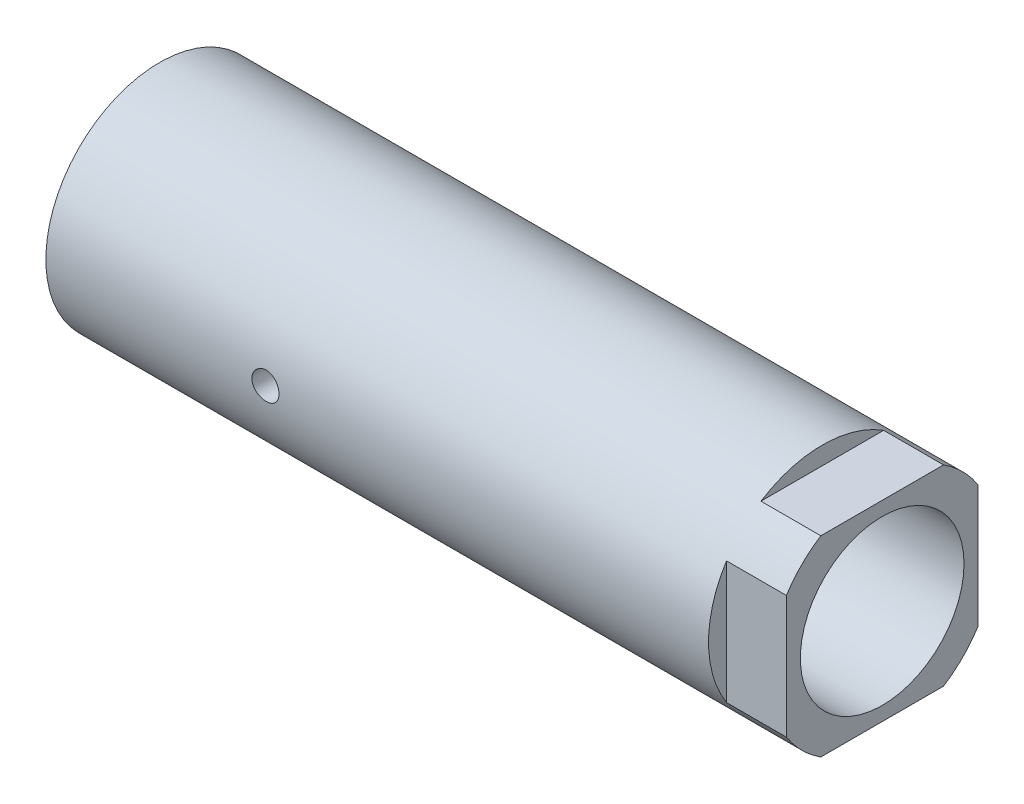
ISO-10303-21;
HEADER;
FILE_DESCRIPTION(('STEP AP214'),'2;1');
FILE_NAME('part.step','',(''),(''),'','','');
FILE_SCHEMA(('AUTOMOTIVE_DESIGN { 1 0 10303 214 1 1 1 1 }'));
ENDSEC;
DATA;
#1=APPLICATION_CONTEXT('core data for automotive mechanical design processes');
#2=APPLICATION_PROTOCOL_DEFINITION('international standard','automotive_design',2000,#1);
#3=PRODUCT_CONTEXT('',#1,'mechanical');
#4=PRODUCT('Part','Part','',(#3));
#5=PRODUCT_RELATED_PRODUCT_CATEGORY('part','',(#4));
#6=PRODUCT_DEFINITION_FORMATION('','',#4);
#7=PRODUCT_DEFINITION_CONTEXT('part definition',#1,'design');
#8=PRODUCT_DEFINITION('design','',#6,#7);
#9=PRODUCT_DEFINITION_SHAPE('','',#8);
#10=(LENGTH_UNIT() NAMED_UNIT(*) SI_UNIT(.MILLI.,.METRE.));
#11=(NAMED_UNIT(*) PLANE_ANGLE_UNIT() SI_UNIT($,.RADIAN.));
#12=(NAMED_UNIT(*) SI_UNIT($,.STERADIAN.) SOLID_ANGLE_UNIT());
#13=UNCERTAINTY_MEASURE_WITH_UNIT(LENGTH_MEASURE(1.E-05),#10,'distance_accuracy_value','');
#14=(GEOMETRIC_REPRESENTATION_CONTEXT(3) GLOBAL_UNCERTAINTY_ASSIGNED_CONTEXT((#13)) GLOBAL_UNIT_ASSIGNED_CONTEXT((#10,
#11,#12)) REPRESENTATION_CONTEXT('',''));
#15=CARTESIAN_POINT('',(0.,0.,0.));
#16=DIRECTION('',(0.,0.,1.));
#17=DIRECTION('',(1.,0.,0.));
#18=AXIS2_PLACEMENT_3D('',#15,#16,#17);
#19=CARTESIAN_POINT('',(75.,0.,0.));
#20=DIRECTION('',(-1.,0.,0.));
#21=DIRECTION('',(0.,0.,1.));
#22=AXIS2_PLACEMENT_3D('',#19,#20,#21);
#23=CYLINDRICAL_SURFACE('',#22,28.5);
#24=CARTESIAN_POINT('',(-101.,0.,0.));
#25=DIRECTION('',(1.,0.,0.));
#26=DIRECTION('',(0.,0.,-1.));
#27=AXIS2_PLACEMENT_3D('',#24,#25,#26);
#28=CIRCLE('',#27,28.5);
#29=CARTESIAN_POINT('',(-101.,0.,-28.5));
#30=VERTEX_POINT('',#29);
#31=EDGE_CURVE('E38',#30,#30,#28,.T.);
#32=ORIENTED_EDGE('',*,*,#31,.T.);
#33=EDGE_LOOP('',(#32));
#34=FACE_BOUND('',#33,.T.);
#35=CARTESIAN_POINT('',(-49.4,0.,28.5));
#36=CARTESIAN_POINT('',(-49.399991875579,0.190254427955505,28.4999974463091));
#37=CARTESIAN_POINT('',(-49.3839770226144,0.380629453835836,28.4980747574117));
#38=CARTESIAN_POINT('',(-49.3203407019856,0.75608685476575,28.4905896965128));
#39=CARTESIAN_POINT('',(-49.2726857814171,0.941163411493595,28.4850234723055));
#40=CARTESIAN_POINT('',(-49.1471891713517,1.30053362944608,28.47087871861));
#41=CARTESIAN_POINT('',(-49.0693672872592,1.47483427846422,28.4623021658303));
#42=CARTESIAN_POINT('',(-48.8857879916944,1.80786668293135,28.4430919052472));
#43=CARTESIAN_POINT('',(-48.7800355599482,1.96660120674753,28.4324585642383));
#44=CARTESIAN_POINT('',(-48.5430273914323,2.26482899166625,28.4102630390044));
#45=CARTESIAN_POINT('',(-48.411659247254,2.404232634524,28.3986968976398));
#46=CARTESIAN_POINT('',(-48.1273897875301,2.65907002876063,28.3759714517189));
#47=CARTESIAN_POINT('',(-47.9744874013064,2.77450258759543,28.3648121674261));
#48=CARTESIAN_POINT('',(-47.6509121482774,2.97845129979335,28.3441247112598));
#49=CARTESIAN_POINT('',(-47.4801864105721,3.06688413123423,28.3346016275054));
#50=CARTESIAN_POINT('',(-47.1261749502887,3.21379102808054,28.3183163872641));
#51=CARTESIAN_POINT('',(-46.9428896627764,3.27226613063469,28.3115541351978));
#52=CARTESIAN_POINT('',(-46.569888675383,3.35732680839541,28.301593607365));
#53=CARTESIAN_POINT('',(-46.3802078133181,3.38406314501326,28.2983784876554));
#54=CARTESIAN_POINT('',(-45.9990261695422,3.40535373616499,28.2958245590423));
#55=CARTESIAN_POINT('',(-45.8075254549768,3.39990917348337,28.2964856076733));
#56=CARTESIAN_POINT('',(-45.4291879455048,3.35711639411199,28.3015939147836));
#57=CARTESIAN_POINT('',(-45.2423321048823,3.31993388320675,28.3060215075005));
#58=CARTESIAN_POINT('',(-44.8775314734487,3.21497904934184,28.3181333472886));
#59=CARTESIAN_POINT('',(-44.6995868484952,3.14720615726215,28.3258176549494));
#60=CARTESIAN_POINT('',(-44.357142912306,2.98281509347476,28.3435994881169));
#61=CARTESIAN_POINT('',(-44.1926786742535,2.88612454087691,28.3537030562283));
#62=CARTESIAN_POINT('',(-43.8822482423985,2.66669467918079,28.375180228527));
#63=CARTESIAN_POINT('',(-43.7362828199389,2.5439542844557,28.386553885636));
#64=CARTESIAN_POINT('',(-43.4660313568152,2.27498876846868,28.4093772012514));
#65=CARTESIAN_POINT('',(-43.3418874935387,2.12862074792311,28.4208268877065));
#66=CARTESIAN_POINT('',(-43.119908909581,1.81704787976282,28.4424450819563));
#67=CARTESIAN_POINT('',(-43.0220742407265,1.65184299504203,28.452613587227));
#68=CARTESIAN_POINT('',(-42.8554925473782,1.30717906769449,28.4705292319653));
#69=CARTESIAN_POINT('',(-42.7867540072489,1.12771588547445,28.4782756649902));
#70=CARTESIAN_POINT('',(-42.6804265232856,0.759681735505423,28.4904677846206));
#71=CARTESIAN_POINT('',(-42.6428362518489,0.571111156294875,28.4949136119037));
#72=CARTESIAN_POINT('',(-42.6000556614655,0.191444844118118,28.4999853683202));
#73=CARTESIAN_POINT('',(-42.5946694033522,0.000371485720870548,28.500634397822));
#74=CARTESIAN_POINT('',(-42.6159332571028,-0.379955160057488,28.4981016954834));
#75=CARTESIAN_POINT('',(-42.6425827488148,-0.569208482599582,28.4949200377981));
#76=CARTESIAN_POINT('',(-42.7269988954293,-0.939947816378015,28.4850979284813));
#77=CARTESIAN_POINT('',(-42.7846725393719,-1.12145530314215,28.4784678173313));
#78=CARTESIAN_POINT('',(-42.9294034240731,-1.47222143208206,28.4624914387476));
#79=CARTESIAN_POINT('',(-43.0164615808413,-1.6414796922103,28.4531450866411));
#80=CARTESIAN_POINT('',(-43.2179672221263,-1.96382051350832,28.4327214475897));
#81=CARTESIAN_POINT('',(-43.332541945509,-2.1168230209667,28.4216362049906));
#82=CARTESIAN_POINT('',(-43.5856477597472,-2.40149570710157,28.3990008549115));
#83=CARTESIAN_POINT('',(-43.7241797139212,-2.53316511669117,28.3874507306907));
#84=CARTESIAN_POINT('',(-44.0221286997918,-2.77212552887184,28.3651165414501));
#85=CARTESIAN_POINT('',(-44.1816500160449,-2.87928696048685,28.3543367462025));
#86=CARTESIAN_POINT('',(-44.5165414186976,-3.06529546374377,28.3348327647447));
#87=CARTESIAN_POINT('',(-44.6919112114721,-3.1441430598222,28.3261085404617));
#88=CARTESIAN_POINT('',(-45.0530969087727,-3.27107414959455,28.3117320613868));
#89=CARTESIAN_POINT('',(-45.238886483827,-3.31923169210411,28.3060724173933));
#90=CARTESIAN_POINT('',(-45.6159866949524,-3.38365459393761,28.2984443238459));
#91=CARTESIAN_POINT('',(-45.8072970984987,-3.39992129444818,28.2964757190636));
#92=CARTESIAN_POINT('',(-46.188719663986,-3.40007764406136,28.2964568297373));
#93=CARTESIAN_POINT('',(-46.3788317735391,-3.38417084034845,28.2983819116014));
#94=CARTESIAN_POINT('',(-46.7536604446726,-3.32086170063862,28.3058806371156));
#95=CARTESIAN_POINT('',(-46.9383770041371,-3.27345935229072,28.3114542821963));
#96=CARTESIAN_POINT('',(-47.2971505034406,-3.14856655583701,28.3256147031661));
#97=CARTESIAN_POINT('',(-47.4712105717375,-3.07108498768901,28.3342005897122));
#98=CARTESIAN_POINT('',(-47.8038905088758,-2.88825330710584,28.3534196385304));
#99=CARTESIAN_POINT('',(-47.9625102526925,-2.78290296903474,28.3640528173781));
#100=CARTESIAN_POINT('',(-48.2608483528776,-2.5465663690818,28.3862490021881));
#101=CARTESIAN_POINT('',(-48.4004460817082,-2.41542831820195,28.3978172624137));
#102=CARTESIAN_POINT('',(-48.6557344147216,-2.1315529647339,28.4205333049226));
#103=CARTESIAN_POINT('',(-48.7714193540819,-1.97881055858071,28.431680987063));
#104=CARTESIAN_POINT('',(-48.975935517637,-1.65545862600372,28.4523421448329));
#105=CARTESIAN_POINT('',(-49.0646720098962,-1.48478884467296,28.4618498058465));
#106=CARTESIAN_POINT('',(-49.2121010524544,-1.13095580140619,28.4780999679103));
#107=CARTESIAN_POINT('',(-49.2708265538219,-0.947806493165276,28.4848455000609));
#108=CARTESIAN_POINT('',(-49.3423635763965,-0.63640557510623,28.4931681372977));
#109=CARTESIAN_POINT('',(-49.3639465561105,-0.5101248099761,28.4957177379198));
#110=CARTESIAN_POINT('',(-49.3927674539478,-0.255914214020097,28.499134522739));
#111=CARTESIAN_POINT('',(-49.4000054653083,-0.127984393917938,28.5000017178711));
#112=CARTESIAN_POINT('',(-49.4,0.,28.5));
#113=B_SPLINE_CURVE_WITH_KNOTS('',3,(#35,#36,#37,#38,#39,#40,#41,#42,#43,#44,#45,#46,#47,#48,
#49,#50,#51,#52,#53,#54,#55,#56,#57,#58,#59,#60,#61,#62,#63,#64,#65,#66,#67,#68,#69,#70,#71,#72,
#73,#74,#75,#76,#77,#78,#79,#80,#81,#82,#83,#84,#85,#86,#87,#88,#89,#90,#91,#92,#93,#94,#95,#96,
#97,#98,#99,#100,#101,#102,#103,#104,#105,#106,#107,#108,#109,#110,#111,#112),.UNSPECIFIED.,.T.,
.F.,(4,2,2,2,2,2,2,2,2,2,2,2,2,2,2,2,2,2,2,2,2,2,2,2,2,2,2,2,2,2,2,2,2,2,2,2,2,2,4),(0.,
0.570295831633368,1.14119559679368,1.71172118432199,2.28214512165548,2.85513094893746,
3.42814527502397,4.00291047040008,4.57765576582737,5.14965991427901,5.72164303928366,
6.29065794474916,6.85968343691254,7.43014529229229,8.0006309263322,8.57470586320817,
9.14878193095365,9.72302528283904,10.2972441580414,10.8679657237631,11.4386762415673,
12.0076852180546,12.5767119340187,13.1484223304703,13.7201533332671,14.2948405237096,
14.8695170690911,15.4428017348985,16.0160622903915,16.5857074308655,17.1553527947258,
17.7248301161696,18.2943120484548,18.8672521520902,19.4403278272691,20.0153953197548,
20.5898300433459,20.9734712629329,21.3571099889792),.UNSPECIFIED.);
#114=CARTESIAN_POINT('',(-49.4,0.,28.5));
#115=VERTEX_POINT('',#114);
#116=EDGE_CURVE('E11',#115,#115,#113,.T.);
#117=ORIENTED_EDGE('',*,*,#116,.T.);
#118=EDGE_LOOP('',(#117));
#119=FACE_BOUND('',#118,.T.);
#120=DIRECTION('',(1.,0.,0.));
#121=VECTOR('',#120,1.);
#122=CARTESIAN_POINT('',(65.,15.3704261489394,24.));
#123=LINE('',#122,#121);
#124=CARTESIAN_POINT('',(65.,15.3704261489394,24.));
#125=VERTEX_POINT('',#124);
#126=CARTESIAN_POINT('',(80.,15.3704261489394,24.));
#127=VERTEX_POINT('',#126);
#128=EDGE_CURVE('E98',#125,#127,#123,.T.);
#129=ORIENTED_EDGE('',*,*,#128,.T.);
#130=CARTESIAN_POINT('',(80.,0.,0.));
#131=DIRECTION('',(1.,0.,0.));
#132=DIRECTION('',(0.,0.,-1.));
#133=AXIS2_PLACEMENT_3D('',#130,#131,#132);
#134=CIRCLE('',#133,28.5);
#135=CARTESIAN_POINT('',(80.,24.,15.3704261489394));
#136=VERTEX_POINT('',#135);
#137=EDGE_CURVE('E162',#136,#127,#134,.T.);
#138=ORIENTED_EDGE('',*,*,#137,.F.);
#139=DIRECTION('',(1.,0.,0.));
#140=VECTOR('',#139,1.);
#141=CARTESIAN_POINT('',(65.,24.,15.3704261489394));
#142=LINE('',#141,#140);
#143=CARTESIAN_POINT('',(65.,24.,15.3704261489394));
#144=VERTEX_POINT('',#143);
#145=EDGE_CURVE('E126',#144,#136,#142,.T.);
#146=ORIENTED_EDGE('',*,*,#145,.F.);
#147=CARTESIAN_POINT('',(65.,0.,0.));
#148=DIRECTION('',(1.,0.,0.));
#149=DIRECTION('',(0.,0.,-1.));
#150=AXIS2_PLACEMENT_3D('',#147,#148,#149);
#151=CIRCLE('',#150,28.5);
#152=CARTESIAN_POINT('',(65.,24.,-15.3704261489394));
#153=VERTEX_POINT('',#152);
#154=EDGE_CURVE('E120',#153,#144,#151,.T.);
#155=ORIENTED_EDGE('',*,*,#154,.F.);
#156=DIRECTION('',(1.,0.,0.));
#157=VECTOR('',#156,1.);
#158=CARTESIAN_POINT('',(65.,24.,-15.3704261489394));
#159=LINE('',#158,#157);
#160=CARTESIAN_POINT('',(80.,24.,-15.3704261489394));
#161=VERTEX_POINT('',#160);
#162=EDGE_CURVE('E117',#153,#161,#159,.T.);
#163=ORIENTED_EDGE('',*,*,#162,.T.);
#164=CARTESIAN_POINT('',(80.,15.3704261489394,-24.));
#165=VERTEX_POINT('',#164);
#166=EDGE_CURVE('E158',#165,#161,#134,.T.);
#167=ORIENTED_EDGE('',*,*,#166,.F.);
#168=DIRECTION('',(1.,0.,0.));
#169=VECTOR('',#168,1.);
#170=CARTESIAN_POINT('',(65.,15.3704261489394,-24.));
#171=LINE('',#170,#169);
#172=CARTESIAN_POINT('',(65.,15.3704261489394,-24.));
#173=VERTEX_POINT('',#172);
#174=EDGE_CURVE('E128',#173,#165,#171,.T.);
#175=ORIENTED_EDGE('',*,*,#174,.F.);
#176=CARTESIAN_POINT('',(65.,0.,0.));
#177=DIRECTION('',(1.,0.,0.));
#178=DIRECTION('',(0.,0.,-1.));
#179=AXIS2_PLACEMENT_3D('',#176,#177,#178);
#180=CIRCLE('',#179,28.5);
#181=CARTESIAN_POINT('',(65.,-15.3704261489394,-24.));
#182=VERTEX_POINT('',#181);
#183=EDGE_CURVE('E134',#182,#173,#180,.T.);
#184=ORIENTED_EDGE('',*,*,#183,.F.);
#185=DIRECTION('',(1.,0.,0.));
#186=VECTOR('',#185,1.);
#187=CARTESIAN_POINT('',(65.,-15.3704261489394,-24.));
#188=LINE('',#187,#186);
#189=CARTESIAN_POINT('',(80.,-15.3704261489394,-24.));
#190=VERTEX_POINT('',#189);
#191=EDGE_CURVE('E138',#182,#190,#188,.T.);
#192=ORIENTED_EDGE('',*,*,#191,.T.);
#193=CARTESIAN_POINT('',(80.,-24.,-15.3704261489394));
#194=VERTEX_POINT('',#193);
#195=EDGE_CURVE('E157',#194,#190,#134,.T.);
#196=ORIENTED_EDGE('',*,*,#195,.F.);
#197=DIRECTION('',(1.,0.,0.));
#198=VECTOR('',#197,1.);
#199=CARTESIAN_POINT('',(65.,-24.,-15.3704261489394));
#200=LINE('',#199,#198);
#201=CARTESIAN_POINT('',(65.,-24.,-15.3704261489394));
#202=VERTEX_POINT('',#201);
#203=EDGE_CURVE('E50',#202,#194,#200,.T.);
#204=ORIENTED_EDGE('',*,*,#203,.F.);
#205=CARTESIAN_POINT('',(65.,0.,0.));
#206=DIRECTION('',(1.,0.,0.));
#207=DIRECTION('',(0.,0.,-1.));
#208=AXIS2_PLACEMENT_3D('',#205,#206,#207);
#209=CIRCLE('',#208,28.5);
#210=CARTESIAN_POINT('',(65.,-24.,15.3704261489394));
#211=VERTEX_POINT('',#210);
#212=EDGE_CURVE('E146',#211,#202,#209,.T.);
#213=ORIENTED_EDGE('',*,*,#212,.F.);
#214=DIRECTION('',(1.,0.,0.));
#215=VECTOR('',#214,1.);
#216=CARTESIAN_POINT('',(65.,-24.,15.3704261489394));
#217=LINE('',#216,#215);
#218=CARTESIAN_POINT('',(80.,-24.,15.3704261489394));
#219=VERTEX_POINT('',#218);
#220=EDGE_CURVE('E150',#211,#219,#217,.T.);
#221=ORIENTED_EDGE('',*,*,#220,.T.);
#222=CARTESIAN_POINT('',(80.,-15.3704261489394,24.));
#223=VERTEX_POINT('',#222);
#224=EDGE_CURVE('E307',#223,#219,#134,.T.);
#225=ORIENTED_EDGE('',*,*,#224,.F.);
#226=DIRECTION('',(1.,0.,0.));
#227=VECTOR('',#226,1.);
#228=CARTESIAN_POINT('',(65.,-15.3704261489394,24.));
#229=LINE('',#228,#227);
#230=CARTESIAN_POINT('',(65.,-15.3704261489394,24.));
#231=VERTEX_POINT('',#230);
#232=EDGE_CURVE('E58',#231,#223,#229,.T.);
#233=ORIENTED_EDGE('',*,*,#232,.F.);
#234=CARTESIAN_POINT('',(65.,0.,0.));
#235=DIRECTION('',(1.,0.,0.));
#236=DIRECTION('',(0.,0.,-1.));
#237=AXIS2_PLACEMENT_3D('',#234,#235,#236);
#238=CIRCLE('',#237,28.5);
#239=EDGE_CURVE('E108',#125,#231,#238,.T.);
#240=ORIENTED_EDGE('',*,*,#239,.F.);
#241=EDGE_LOOP('',(#129,#138,#146,#155,#163,#167,#175,#184,#192,#196,#204,#213,#221,#225,#233,#240));
#242=FACE_BOUND('',#241,.T.);
#243=ADVANCED_FACE('F34',(#34,#119,#242),#23,.T.);
#244=CARTESIAN_POINT('',(80.,0.,0.));
#245=DIRECTION('',(1.,0.,0.));
#246=DIRECTION('',(0.,0.,-1.));
#247=AXIS2_PLACEMENT_3D('',#244,#245,#246);
#248=PLANE('',#247);
#249=CARTESIAN_POINT('',(80.,0.,0.));
#250=DIRECTION('',(1.,0.,0.));
#251=DIRECTION('',(0.,0.,-1.));
#252=AXIS2_PLACEMENT_3D('',#249,#250,#251);
#253=CIRCLE('',#252,20.5);
#254=CARTESIAN_POINT('',(80.,0.,-20.5));
#255=VERTEX_POINT('',#254);
#256=EDGE_CURVE('E118',#255,#255,#253,.T.);
#257=ORIENTED_EDGE('',*,*,#256,.F.);
#258=EDGE_LOOP('',(#257));
#259=FACE_BOUND('',#258,.T.);
#260=ORIENTED_EDGE('',*,*,#137,.T.);
#261=DIRECTION('',(0.,-1.,0.));
#262=VECTOR('',#261,1.);
#263=CARTESIAN_POINT('',(80.,0.,24.));
#264=LINE('',#263,#262);
#265=EDGE_CURVE('E103',#127,#223,#264,.T.);
#266=ORIENTED_EDGE('',*,*,#265,.T.);
#267=ORIENTED_EDGE('',*,*,#224,.T.);
#268=DIRECTION('',(0.,0.,-1.));
#269=VECTOR('',#268,1.);
#270=CARTESIAN_POINT('',(80.,-24.,0.));
#271=LINE('',#270,#269);
#272=EDGE_CURVE('E147',#219,#194,#271,.T.);
#273=ORIENTED_EDGE('',*,*,#272,.T.);
#274=ORIENTED_EDGE('',*,*,#195,.T.);
#275=DIRECTION('',(0.,1.,0.));
#276=VECTOR('',#275,1.);
#277=CARTESIAN_POINT('',(80.,0.,-24.));
#278=LINE('',#277,#276);
#279=EDGE_CURVE('E135',#190,#165,#278,.T.);
#280=ORIENTED_EDGE('',*,*,#279,.T.);
#281=ORIENTED_EDGE('',*,*,#166,.T.);
#282=DIRECTION('',(0.,0.,-1.));
#283=VECTOR('',#282,1.);
#284=CARTESIAN_POINT('',(80.,24.,0.));
#285=LINE('',#284,#283);
#286=EDGE_CURVE('E123',#136,#161,#285,.T.);
#287=ORIENTED_EDGE('',*,*,#286,.F.);
#288=EDGE_LOOP('',(#260,#266,#267,#273,#274,#280,#281,#287));
#289=FACE_BOUND('',#288,.T.);
#290=ADVANCED_FACE('F178',(#259,#289),#248,.T.);
#291=CARTESIAN_POINT('',(75.,0.,0.));
#292=DIRECTION('',(-1.,0.,0.));
#293=DIRECTION('',(0.,0.,1.));
#294=AXIS2_PLACEMENT_3D('',#291,#292,#293);
#295=CYLINDRICAL_SURFACE('',#294,20.5);
#296=CARTESIAN_POINT('',(-42.6,0.,20.5));
#297=CARTESIAN_POINT('',(-42.6000076133871,-0.189585189566415,20.4999967607409));
#298=CARTESIAN_POINT('',(-42.6159105683785,-0.379274180285722,20.4973426551542));
#299=CARTESIAN_POINT('',(-42.6790762853598,-0.753332901644163,20.4870104733905));
#300=CARTESIAN_POINT('',(-42.7263679713661,-0.937697562368584,20.4793277635571));
#301=CARTESIAN_POINT('',(-42.8508447529632,-1.29564156342884,20.4598001748105));
#302=CARTESIAN_POINT('',(-42.9280054901075,-1.46922955871363,20.4479586881404));
#303=CARTESIAN_POINT('',(-43.1099665055341,-1.80097258696713,20.4214158840039));
#304=CARTESIAN_POINT('',(-43.2147635882121,-1.95912940135611,20.4067148972344));
#305=CARTESIAN_POINT('',(-43.4500783910687,-2.25704083027047,20.3759273757801));
#306=CARTESIAN_POINT('',(-43.5808066022304,-2.396628095009,20.3598301527902));
#307=CARTESIAN_POINT('',(-43.8638197150216,-2.65199256918017,20.3281463196385));
#308=CARTESIAN_POINT('',(-44.0161059701205,-2.76776828254216,20.3125597416122));
#309=CARTESIAN_POINT('',(-44.3390605891587,-2.97289287113048,20.2835584274725));
#310=CARTESIAN_POINT('',(-44.5098352915046,-3.06207644669546,20.2701575015792));
#311=CARTESIAN_POINT('',(-44.8642008249565,-3.21042813147772,20.247192934549));
#312=CARTESIAN_POINT('',(-45.04779079807,-3.2695982479311,20.237629036809));
#313=CARTESIAN_POINT('',(-45.4208022197366,-3.35571651690006,20.2235276949299));
#314=CARTESIAN_POINT('',(-45.6101552604749,-3.38295345884316,20.218945228912));
#315=CARTESIAN_POINT('',(-45.9907951182439,-3.405327575443,20.2151893692139));
#316=CARTESIAN_POINT('',(-46.1820817988115,-3.40046699975104,20.216015596449));
#317=CARTESIAN_POINT('',(-46.5590985641591,-3.35901932308546,20.2229426620489));
#318=CARTESIAN_POINT('',(-46.7448654329291,-3.32275649580265,20.2289895872432));
#319=CARTESIAN_POINT('',(-47.1076412710466,-3.22004251623981,20.2455923271754));
#320=CARTESIAN_POINT('',(-47.2846499424627,-3.15359033777738,20.2561482951819));
#321=CARTESIAN_POINT('',(-47.625856342217,-2.99205478646689,20.2806380332024));
#322=CARTESIAN_POINT('',(-47.7899890723191,-2.89683662018763,20.2945876440893));
#323=CARTESIAN_POINT('',(-48.1000701806055,-2.68056770527556,20.3242818749874));
#324=CARTESIAN_POINT('',(-48.2460171036079,-2.55951489151982,20.3400266384493));
#325=CARTESIAN_POINT('',(-48.5174608622452,-2.29324545275891,20.3717740916488));
#326=CARTESIAN_POINT('',(-48.6426848184765,-2.14775057666471,20.3877775758069));
#327=CARTESIAN_POINT('',(-48.8669825641629,-1.83766851455867,20.4180606667741));
#328=CARTESIAN_POINT('',(-48.9660561881551,-1.67308120775136,20.4323402626751));
#329=CARTESIAN_POINT('',(-49.1352652152365,-1.3292307598346,20.4575866486038));
#330=CARTESIAN_POINT('',(-49.2053766678556,-1.14995561872652,20.4685506948151));
#331=CARTESIAN_POINT('',(-49.3144187177679,-0.781952280418173,20.4859085481081));
#332=CARTESIAN_POINT('',(-49.3533518978003,-0.593224867599626,20.4923027337424));
#333=CARTESIAN_POINT('',(-49.3985626709329,-0.214026394976801,20.4997495495966));
#334=CARTESIAN_POINT('',(-49.4052148999782,-0.0236011631634216,20.5008634564578));
#335=CARTESIAN_POINT('',(-49.3866735083907,0.355643100942499,20.4977919867605));
#336=CARTESIAN_POINT('',(-49.3614811007545,0.544462194138791,20.4936068120496));
#337=CARTESIAN_POINT('',(-49.2802771492395,0.913978267219984,20.4804453716466));
#338=CARTESIAN_POINT('',(-49.2244509293388,1.09471708858067,20.4714979257332));
#339=CARTESIAN_POINT('',(-49.0837615081766,1.44427008030441,20.4498112440155));
#340=CARTESIAN_POINT('',(-48.9988966895163,1.61308358581638,20.4370717970086));
#341=CARTESIAN_POINT('',(-48.8016799702134,1.93562225438735,20.4090625297712));
#342=CARTESIAN_POINT('',(-48.6890938666653,2.08920233892381,20.3937715274203));
#343=CARTESIAN_POINT('',(-48.4399528558016,2.37542303387674,20.3624196623849));
#344=CARTESIAN_POINT('',(-48.30339622548,2.50806213774898,20.3463587444191));
#345=CARTESIAN_POINT('',(-48.0085109058219,2.75002312086281,20.3150792745964));
#346=CARTESIAN_POINT('',(-47.8499733392086,2.85909197991855,20.299871048138));
#347=CARTESIAN_POINT('',(-47.5166067272792,3.04904974622276,20.2722112422556));
#348=CARTESIAN_POINT('',(-47.3417781949429,3.12993954041108,20.2597595760729));
#349=CARTESIAN_POINT('',(-46.9815022524511,3.26086390026965,20.2391000523737));
#350=CARTESIAN_POINT('',(-46.7961017823536,3.31102477366771,20.2308748452844));
#351=CARTESIAN_POINT('',(-46.4193591178564,3.37946510385607,20.2195558729327));
#352=CARTESIAN_POINT('',(-46.2280174359418,3.3977473027468,20.2164616663194));
#353=CARTESIAN_POINT('',(-45.8473501907057,3.4018354209687,20.2157739248499));
#354=CARTESIAN_POINT('',(-45.6580289081318,3.38803958545507,20.2181129368401));
#355=CARTESIAN_POINT('',(-45.2844409295987,3.32922399102502,20.2278803148748));
#356=CARTESIAN_POINT('',(-45.100174217716,3.28420433048647,20.2353086648842));
#357=CARTESIAN_POINT('',(-44.7420778178424,3.16437099731113,20.2543922022976));
#358=CARTESIAN_POINT('',(-44.5682364926492,3.08959128409388,20.2660425705749));
#359=CARTESIAN_POINT('',(-44.2355026268637,2.91240141703404,20.292262172835));
#360=CARTESIAN_POINT('',(-44.0766108163682,2.8099899146677,20.3068315492662));
#361=CARTESIAN_POINT('',(-43.7762737200645,2.57902096199038,20.3374615647257));
#362=CARTESIAN_POINT('',(-43.6350553754542,2.450170427537,20.3535377150135));
#363=CARTESIAN_POINT('',(-43.3761081361822,2.17059904224453,20.3852458884317));
#364=CARTESIAN_POINT('',(-43.2583846715089,2.01987314958088,20.4008778081802));
#365=CARTESIAN_POINT('',(-43.0490346701321,1.69960628482677,20.4300598937779));
#366=CARTESIAN_POINT('',(-42.9575919266198,1.52994380095415,20.4435951071065));
#367=CARTESIAN_POINT('',(-42.8046451740506,1.17751148478599,20.4669131534425));
#368=CARTESIAN_POINT('',(-42.7431112869836,0.994754943383189,20.4766997291407));
#369=CARTESIAN_POINT('',(-42.6651156550789,0.676068855470966,20.4892771671513));
#370=CARTESIAN_POINT('',(-42.6407363009234,0.542069229601953,20.4932767791585));
#371=CARTESIAN_POINT('',(-42.6081758787347,0.272064200530068,20.4986393355893));
#372=CARTESIAN_POINT('',(-42.5999945361315,0.136058831365611,20.5000023247059));
#373=CARTESIAN_POINT('',(-42.6,0.,20.5));
#374=B_SPLINE_CURVE_WITH_KNOTS('',3,(#296,#297,#298,#299,#300,#301,#302,#303,#304,#305,#306,
#307,#308,#309,#310,#311,#312,#313,#314,#315,#316,#317,#318,#319,#320,#321,#322,#323,#324,#325,
#326,#327,#328,#329,#330,#331,#332,#333,#334,#335,#336,#337,#338,#339,#340,#341,#342,#343,#344,
#345,#346,#347,#348,#349,#350,#351,#352,#353,#354,#355,#356,#357,#358,#359,#360,#361,#362,#363,
#364,#365,#366,#367,#368,#369,#370,#371,#372,#373),.UNSPECIFIED.,.T.,.F.,(4,2,2,2,2,2,2,2,2,2,2,
2,2,2,2,2,2,2,2,2,2,2,2,2,2,2,2,2,2,2,2,2,2,2,2,2,2,2,4),(0.,0.568258242173899,1.1370408499985,
1.70536058500621,2.27361463371509,2.84668548264348,3.41979232640193,3.99639075613382,
4.57295061910705,5.1442550968984,5.71551953351776,6.28095424689452,6.84640818170371,
7.41455397195657,7.98274519463379,8.55790774766109,9.13307393986973,9.70871482217925,
10.2843080147387,10.8532049292133,11.4220801744442,11.9875512670869,12.553053860601,
13.1235086993357,13.6940045592729,14.2703498256069,14.8466769497568,15.420618967419,
15.9945116140101,16.561317554666,17.1281217094773,17.6942809258814,18.2604677777487,
18.8333075264714,19.4062795133774,19.9831661295345,20.5594752635275,20.967301756384,
21.3751213361775),.UNSPECIFIED.);
#375=CARTESIAN_POINT('',(-42.6,0.,20.5));
#376=VERTEX_POINT('',#375);
#377=EDGE_CURVE('E164',#376,#376,#374,.T.);
#378=ORIENTED_EDGE('',*,*,#377,.F.);
#379=EDGE_LOOP('',(#378));
#380=FACE_BOUND('',#379,.T.);
#381=CARTESIAN_POINT('',(-101.,0.,0.));
#382=DIRECTION('',(1.,0.,0.));
#383=DIRECTION('',(0.,0.,-1.));
#384=AXIS2_PLACEMENT_3D('',#381,#382,#383);
#385=CIRCLE('',#384,20.5);
#386=CARTESIAN_POINT('',(-101.,0.,-20.5));
#387=VERTEX_POINT('',#386);
#388=EDGE_CURVE('E161',#387,#387,#385,.T.);
#389=ORIENTED_EDGE('',*,*,#388,.F.);
#390=EDGE_LOOP('',(#389));
#391=FACE_BOUND('',#390,.T.);
#392=ORIENTED_EDGE('',*,*,#256,.T.);
#393=EDGE_LOOP('',(#392));
#394=FACE_BOUND('',#393,.T.);
#395=ADVANCED_FACE('F182',(#380,#391,#394),#295,.F.);
#396=CARTESIAN_POINT('',(-101.,0.,0.));
#397=DIRECTION('',(1.,0.,0.));
#398=DIRECTION('',(0.,0.,-1.));
#399=AXIS2_PLACEMENT_3D('',#396,#397,#398);
#400=PLANE('',#399);
#401=ORIENTED_EDGE('',*,*,#388,.T.);
#402=EDGE_LOOP('',(#401));
#403=FACE_BOUND('',#402,.T.);
#404=ORIENTED_EDGE('',*,*,#31,.F.);
#405=EDGE_LOOP('',(#404));
#406=FACE_BOUND('',#405,.T.);
#407=ADVANCED_FACE('F176',(#403,#406),#400,.F.);
#408=CARTESIAN_POINT('',(-46.,0.,0.));
#409=DIRECTION('',(0.,0.,-1.));
#410=DIRECTION('',(-1.,0.,0.));
#411=AXIS2_PLACEMENT_3D('',#408,#409,#410);
#412=CYLINDRICAL_SURFACE('',#411,3.4);
#413=ORIENTED_EDGE('',*,*,#377,.T.);
#414=EDGE_LOOP('',(#413));
#415=FACE_BOUND('',#414,.T.);
#416=ORIENTED_EDGE('',*,*,#116,.F.);
#417=EDGE_LOOP('',(#416));
#418=FACE_BOUND('',#417,.T.);
#419=ADVANCED_FACE('F170',(#415,#418),#412,.F.);
#420=CARTESIAN_POINT('',(65.,-24.,0.));
#421=DIRECTION('',(0.,-1.,0.));
#422=DIRECTION('',(0.,0.,-1.));
#423=AXIS2_PLACEMENT_3D('',#420,#421,#422);
#424=PLANE('',#423);
#425=ORIENTED_EDGE('',*,*,#272,.F.);
#426=ORIENTED_EDGE('',*,*,#220,.F.);
#427=DIRECTION('',(0.,0.,-1.));
#428=VECTOR('',#427,1.);
#429=CARTESIAN_POINT('',(65.,-24.,0.));
#430=LINE('',#429,#428);
#431=EDGE_CURVE('E144',#211,#202,#430,.T.);
#432=ORIENTED_EDGE('',*,*,#431,.T.);
#433=ORIENTED_EDGE('',*,*,#203,.T.);
#434=EDGE_LOOP('',(#425,#426,#432,#433));
#435=FACE_BOUND('',#434,.T.);
#436=ADVANCED_FACE('F175',(#435),#424,.T.);
#437=CARTESIAN_POINT('',(65.,0.,0.));
#438=DIRECTION('',(1.,0.,0.));
#439=DIRECTION('',(0.,0.,-1.));
#440=AXIS2_PLACEMENT_3D('',#437,#438,#439);
#441=PLANE('',#440);
#442=ORIENTED_EDGE('',*,*,#431,.F.);
#443=ORIENTED_EDGE('',*,*,#212,.T.);
#444=EDGE_LOOP('',(#442,#443));
#445=FACE_BOUND('',#444,.T.);
#446=ADVANCED_FACE('F235',(#445),#441,.T.);
#447=CARTESIAN_POINT('',(65.,0.,-24.));
#448=DIRECTION('',(0.,0.,-1.));
#449=DIRECTION('',(-1.,0.,0.));
#450=AXIS2_PLACEMENT_3D('',#447,#448,#449);
#451=PLANE('',#450);
#452=ORIENTED_EDGE('',*,*,#279,.F.);
#453=ORIENTED_EDGE('',*,*,#191,.F.);
#454=DIRECTION('',(0.,1.,0.));
#455=VECTOR('',#454,1.);
#456=CARTESIAN_POINT('',(65.,0.,-24.));
#457=LINE('',#456,#455);
#458=EDGE_CURVE('E132',#182,#173,#457,.T.);
#459=ORIENTED_EDGE('',*,*,#458,.T.);
#460=ORIENTED_EDGE('',*,*,#174,.T.);
#461=EDGE_LOOP('',(#452,#453,#459,#460));
#462=FACE_BOUND('',#461,.T.);
#463=ADVANCED_FACE('F243',(#462),#451,.T.);
#464=CARTESIAN_POINT('',(65.,0.,0.));
#465=DIRECTION('',(1.,0.,0.));
#466=DIRECTION('',(0.,0.,-1.));
#467=AXIS2_PLACEMENT_3D('',#464,#465,#466);
#468=PLANE('',#467);
#469=ORIENTED_EDGE('',*,*,#458,.F.);
#470=ORIENTED_EDGE('',*,*,#183,.T.);
#471=EDGE_LOOP('',(#469,#470));
#472=FACE_BOUND('',#471,.T.);
#473=ADVANCED_FACE('F253',(#472),#468,.T.);
#474=CARTESIAN_POINT('',(65.,24.,0.));
#475=DIRECTION('',(0.,-1.,0.));
#476=DIRECTION('',(0.,0.,-1.));
#477=AXIS2_PLACEMENT_3D('',#474,#475,#476);
#478=PLANE('',#477);
#479=ORIENTED_EDGE('',*,*,#286,.T.);
#480=ORIENTED_EDGE('',*,*,#162,.F.);
#481=DIRECTION('',(0.,0.,-1.));
#482=VECTOR('',#481,1.);
#483=CARTESIAN_POINT('',(65.,24.,0.));
#484=LINE('',#483,#482);
#485=EDGE_CURVE('E122',#144,#153,#484,.T.);
#486=ORIENTED_EDGE('',*,*,#485,.F.);
#487=ORIENTED_EDGE('',*,*,#145,.T.);
#488=EDGE_LOOP('',(#479,#480,#486,#487));
#489=FACE_BOUND('',#488,.T.);
#490=ADVANCED_FACE('F263',(#489),#478,.F.);
#491=CARTESIAN_POINT('',(65.,0.,0.));
#492=DIRECTION('',(1.,0.,0.));
#493=DIRECTION('',(0.,0.,-1.));
#494=AXIS2_PLACEMENT_3D('',#491,#492,#493);
#495=PLANE('',#494);
#496=ORIENTED_EDGE('',*,*,#154,.T.);
#497=ORIENTED_EDGE('',*,*,#485,.T.);
#498=EDGE_LOOP('',(#496,#497));
#499=FACE_BOUND('',#498,.T.);
#500=ADVANCED_FACE('F273',(#499),#495,.T.);
#501=CARTESIAN_POINT('',(65.,0.,24.));
#502=DIRECTION('',(0.,0.,1.));
#503=DIRECTION('',(1.,0.,0.));
#504=AXIS2_PLACEMENT_3D('',#501,#502,#503);
#505=PLANE('',#504);
#506=ORIENTED_EDGE('',*,*,#265,.F.);
#507=ORIENTED_EDGE('',*,*,#128,.F.);
#508=DIRECTION('',(0.,-1.,0.));
#509=VECTOR('',#508,1.);
#510=CARTESIAN_POINT('',(65.,0.,24.));
#511=LINE('',#510,#509);
#512=EDGE_CURVE('E101',#125,#231,#511,.T.);
#513=ORIENTED_EDGE('',*,*,#512,.T.);
#514=ORIENTED_EDGE('',*,*,#232,.T.);
#515=EDGE_LOOP('',(#506,#507,#513,#514));
#516=FACE_BOUND('',#515,.T.);
#517=ADVANCED_FACE('F100',(#516),#505,.T.);
#518=CARTESIAN_POINT('',(65.,0.,0.));
#519=DIRECTION('',(1.,0.,0.));
#520=DIRECTION('',(0.,0.,-1.));
#521=AXIS2_PLACEMENT_3D('',#518,#519,#520);
#522=PLANE('',#521);
#523=ORIENTED_EDGE('',*,*,#512,.F.);
#524=ORIENTED_EDGE('',*,*,#239,.T.);
#525=EDGE_LOOP('',(#523,#524));
#526=FACE_BOUND('',#525,.T.);
#527=ADVANCED_FACE('F111',(#526),#522,.T.);
#528=CLOSED_SHELL('',(#243,#290,#395,#407,#419,#436,#446,#463,#473,#490,#500,#517,#527));
#529=MANIFOLD_SOLID_BREP('B2',#528);
#530=ADVANCED_BREP_SHAPE_REPRESENTATION('',(#18,#529),#14);
#531=SHAPE_DEFINITION_REPRESENTATION(#9,#530);
ENDSEC;
END-ISO-10303-21;
